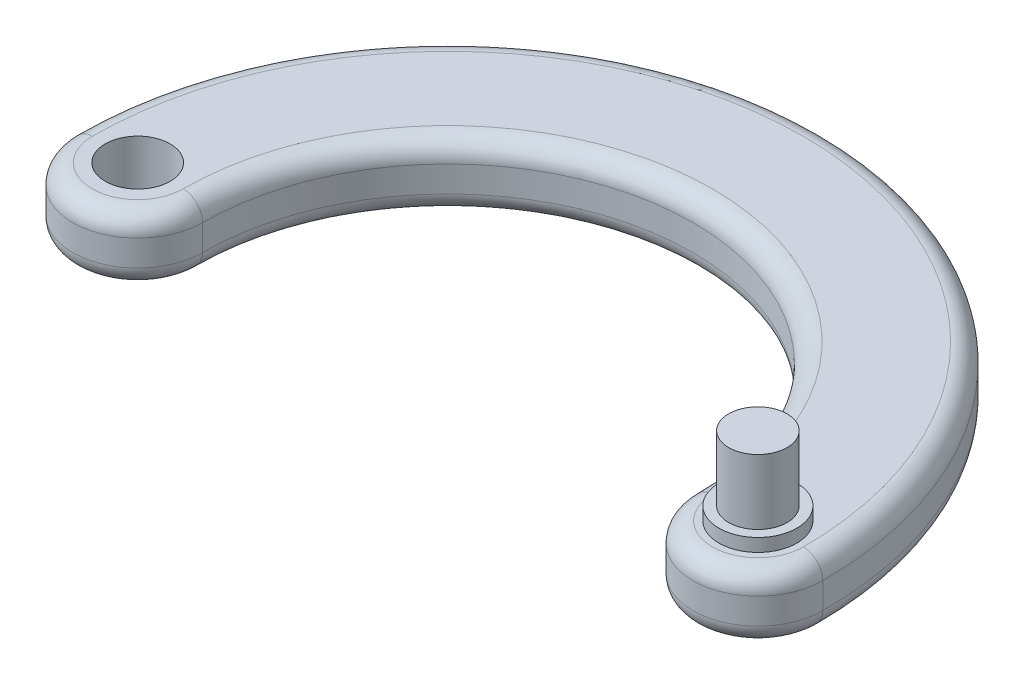
ISO-10303-21;
HEADER;
FILE_DESCRIPTION(('STEP AP214'),'2;1');
FILE_NAME('part.step','',(''),(''),'','','');
FILE_SCHEMA(('AUTOMOTIVE_DESIGN { 1 0 10303 214 1 1 1 1 }'));
ENDSEC;
DATA;
#1=APPLICATION_CONTEXT('core data for automotive mechanical design processes');
#2=APPLICATION_PROTOCOL_DEFINITION('international standard','automotive_design',2000,#1);
#3=PRODUCT_CONTEXT('',#1,'mechanical');
#4=PRODUCT('Part','Part','',(#3));
#5=PRODUCT_RELATED_PRODUCT_CATEGORY('part','',(#4));
#6=PRODUCT_DEFINITION_FORMATION('','',#4);
#7=PRODUCT_DEFINITION_CONTEXT('part definition',#1,'design');
#8=PRODUCT_DEFINITION('design','',#6,#7);
#9=PRODUCT_DEFINITION_SHAPE('','',#8);
#10=(LENGTH_UNIT() NAMED_UNIT(*) SI_UNIT(.MILLI.,.METRE.));
#11=(NAMED_UNIT(*) PLANE_ANGLE_UNIT() SI_UNIT($,.RADIAN.));
#12=(NAMED_UNIT(*) SI_UNIT($,.STERADIAN.) SOLID_ANGLE_UNIT());
#13=UNCERTAINTY_MEASURE_WITH_UNIT(LENGTH_MEASURE(1.E-05),#10,'distance_accuracy_value','');
#14=(GEOMETRIC_REPRESENTATION_CONTEXT(3) GLOBAL_UNCERTAINTY_ASSIGNED_CONTEXT((#13)) GLOBAL_UNIT_ASSIGNED_CONTEXT((#10,
#11,#12)) REPRESENTATION_CONTEXT('',''));
#15=CARTESIAN_POINT('',(0.,0.,0.));
#16=DIRECTION('',(0.,0.,1.));
#17=DIRECTION('',(1.,0.,0.));
#18=AXIS2_PLACEMENT_3D('',#15,#16,#17);
#19=CARTESIAN_POINT('',(-71.625,10.,0.));
#20=DIRECTION('',(0.,1.,0.));
#21=DIRECTION('',(0.,0.,1.));
#22=AXIS2_PLACEMENT_3D('',#19,#20,#21);
#23=PLANE('',#22);
#24=CARTESIAN_POINT('',(0.,10.,0.));
#25=DIRECTION('',(0.,1.,0.));
#26=DIRECTION('',(0.,0.,1.));
#27=AXIS2_PLACEMENT_3D('',#24,#25,#26);
#28=CIRCLE('',#27,7.);
#29=CARTESIAN_POINT('',(-7.00000000000001,10.,0.));
#30=VERTEX_POINT('',#29);
#31=CARTESIAN_POINT('',(7.,10.,0.));
#32=VERTEX_POINT('',#31);
#33=EDGE_CURVE('E42',#30,#32,#28,.T.);
#34=ORIENTED_EDGE('',*,*,#33,.T.);
#35=CARTESIAN_POINT('',(-47.75,10.,0.));
#36=DIRECTION('',(0.,1.,0.));
#37=DIRECTION('',(0.,0.,1.));
#38=AXIS2_PLACEMENT_3D('',#35,#36,#37);
#39=CIRCLE('',#38,54.75);
#40=CARTESIAN_POINT('',(-102.5,10.,0.));
#41=VERTEX_POINT('',#40);
#42=EDGE_CURVE('E11',#32,#41,#39,.T.);
#43=ORIENTED_EDGE('',*,*,#42,.T.);
#44=CARTESIAN_POINT('',(-95.5,10.,0.));
#45=DIRECTION('',(0.,1.,0.));
#46=DIRECTION('',(0.,0.,1.));
#47=AXIS2_PLACEMENT_3D('',#44,#45,#46);
#48=CIRCLE('',#47,7.00000000000001);
#49=CARTESIAN_POINT('',(-88.5,10.,0.));
#50=VERTEX_POINT('',#49);
#51=EDGE_CURVE('E205',#41,#50,#48,.T.);
#52=ORIENTED_EDGE('',*,*,#51,.T.);
#53=CARTESIAN_POINT('',(-47.75,10.,0.));
#54=DIRECTION('',(0.,1.,0.));
#55=DIRECTION('',(0.,0.,1.));
#56=AXIS2_PLACEMENT_3D('',#53,#54,#55);
#57=CIRCLE('',#56,40.75);
#58=EDGE_CURVE('E203',#50,#30,#57,.F.);
#59=ORIENTED_EDGE('',*,*,#58,.T.);
#60=EDGE_LOOP('',(#34,#43,#52,#59));
#61=FACE_BOUND('',#60,.T.);
#62=CARTESIAN_POINT('',(0.,10.,0.));
#63=DIRECTION('',(0.,1.,0.));
#64=DIRECTION('',(0.,0.,1.));
#65=AXIS2_PLACEMENT_3D('',#62,#63,#64);
#66=CIRCLE('',#65,6.);
#67=CARTESIAN_POINT('',(0.,10.,6.));
#68=VERTEX_POINT('',#67);
#69=EDGE_CURVE('E157',#68,#68,#66,.T.);
#70=ORIENTED_EDGE('',*,*,#69,.F.);
#71=EDGE_LOOP('',(#70));
#72=FACE_BOUND('',#71,.T.);
#73=CARTESIAN_POINT('',(-95.5,10.,0.));
#74=DIRECTION('',(0.,1.,0.));
#75=DIRECTION('',(0.,0.,1.));
#76=AXIS2_PLACEMENT_3D('',#73,#74,#75);
#77=CIRCLE('',#76,5.);
#78=CARTESIAN_POINT('',(-95.5,10.,5.00000000000002));
#79=VERTEX_POINT('',#78);
#80=EDGE_CURVE('E123',#79,#79,#77,.T.);
#81=ORIENTED_EDGE('',*,*,#80,.F.);
#82=EDGE_LOOP('',(#81));
#83=FACE_BOUND('',#82,.T.);
#84=ADVANCED_FACE('F33',(#61,#72,#83),#23,.T.);
#85=CARTESIAN_POINT('',(-71.625,0.,0.));
#86=DIRECTION('',(0.,1.,0.));
#87=DIRECTION('',(0.,0.,1.));
#88=AXIS2_PLACEMENT_3D('',#85,#86,#87);
#89=PLANE('',#88);
#90=CARTESIAN_POINT('',(-47.75,0.,0.));
#91=DIRECTION('',(0.,1.,0.));
#92=DIRECTION('',(0.,0.,1.));
#93=AXIS2_PLACEMENT_3D('',#90,#91,#92);
#94=CIRCLE('',#93,54.75);
#95=CARTESIAN_POINT('',(-102.5,0.,0.));
#96=VERTEX_POINT('',#95);
#97=CARTESIAN_POINT('',(7.00000000000001,0.,0.));
#98=VERTEX_POINT('',#97);
#99=EDGE_CURVE('E186',#96,#98,#94,.F.);
#100=ORIENTED_EDGE('',*,*,#99,.T.);
#101=CARTESIAN_POINT('',(0.,0.,0.));
#102=DIRECTION('',(0.,1.,0.));
#103=DIRECTION('',(0.,0.,1.));
#104=AXIS2_PLACEMENT_3D('',#101,#102,#103);
#105=CIRCLE('',#104,7.);
#106=CARTESIAN_POINT('',(-7.00000000000001,0.,0.));
#107=VERTEX_POINT('',#106);
#108=EDGE_CURVE('E192',#98,#107,#105,.F.);
#109=ORIENTED_EDGE('',*,*,#108,.T.);
#110=CARTESIAN_POINT('',(-47.75,0.,0.));
#111=DIRECTION('',(0.,1.,0.));
#112=DIRECTION('',(0.,0.,1.));
#113=AXIS2_PLACEMENT_3D('',#110,#111,#112);
#114=CIRCLE('',#113,40.75);
#115=CARTESIAN_POINT('',(-88.5,0.,0.));
#116=VERTEX_POINT('',#115);
#117=EDGE_CURVE('E190',#107,#116,#114,.T.);
#118=ORIENTED_EDGE('',*,*,#117,.T.);
#119=CARTESIAN_POINT('',(-95.5,0.,0.));
#120=DIRECTION('',(0.,1.,0.));
#121=DIRECTION('',(0.,0.,1.));
#122=AXIS2_PLACEMENT_3D('',#119,#120,#121);
#123=CIRCLE('',#122,7.00000000000001);
#124=EDGE_CURVE('E188',#116,#96,#123,.F.);
#125=ORIENTED_EDGE('',*,*,#124,.T.);
#126=EDGE_LOOP('',(#100,#109,#118,#125));
#127=FACE_BOUND('',#126,.T.);
#128=CARTESIAN_POINT('',(-95.5,0.,0.));
#129=DIRECTION('',(0.,1.,0.));
#130=DIRECTION('',(0.,0.,1.));
#131=AXIS2_PLACEMENT_3D('',#128,#129,#130);
#132=CIRCLE('',#131,5.);
#133=CARTESIAN_POINT('',(-95.5,0.,5.00000000000002));
#134=VERTEX_POINT('',#133);
#135=EDGE_CURVE('E173',#134,#134,#132,.T.);
#136=ORIENTED_EDGE('',*,*,#135,.T.);
#137=EDGE_LOOP('',(#136));
#138=FACE_BOUND('',#137,.T.);
#139=ADVANCED_FACE('F225',(#127,#138),#89,.F.);
#140=CARTESIAN_POINT('',(-47.75,10.,0.));
#141=DIRECTION('',(0.,-1.,0.));
#142=DIRECTION('',(0.,0.,-1.));
#143=AXIS2_PLACEMENT_3D('',#140,#141,#142);
#144=CYLINDRICAL_SURFACE('',#143,57.75);
#145=DIRECTION('',(0.,-1.,0.));
#146=VECTOR('',#145,1.);
#147=CARTESIAN_POINT('',(10.,10.,0.));
#148=LINE('',#147,#146);
#149=CARTESIAN_POINT('',(10.,7.,0.));
#150=VERTEX_POINT('',#149);
#151=CARTESIAN_POINT('',(10.,3.,0.));
#152=VERTEX_POINT('',#151);
#153=EDGE_CURVE('E104',#150,#152,#148,.T.);
#154=ORIENTED_EDGE('',*,*,#153,.T.);
#155=CARTESIAN_POINT('',(-47.75,3.,0.));
#156=DIRECTION('',(0.,1.,0.));
#157=DIRECTION('',(0.,0.,1.));
#158=AXIS2_PLACEMENT_3D('',#155,#156,#157);
#159=CIRCLE('',#158,57.75);
#160=CARTESIAN_POINT('',(-105.5,3.,0.));
#161=VERTEX_POINT('',#160);
#162=EDGE_CURVE('E110',#152,#161,#159,.T.);
#163=ORIENTED_EDGE('',*,*,#162,.T.);
#164=DIRECTION('',(0.,-1.,0.));
#165=VECTOR('',#164,1.);
#166=CARTESIAN_POINT('',(-105.5,10.,0.));
#167=LINE('',#166,#165);
#168=CARTESIAN_POINT('',(-105.5,7.,0.));
#169=VERTEX_POINT('',#168);
#170=EDGE_CURVE('E106',#169,#161,#167,.T.);
#171=ORIENTED_EDGE('',*,*,#170,.F.);
#172=CARTESIAN_POINT('',(-47.75,7.,0.));
#173=DIRECTION('',(0.,1.,0.));
#174=DIRECTION('',(0.,0.,1.));
#175=AXIS2_PLACEMENT_3D('',#172,#173,#174);
#176=CIRCLE('',#175,57.75);
#177=EDGE_CURVE('E101',#169,#150,#176,.F.);
#178=ORIENTED_EDGE('',*,*,#177,.T.);
#179=EDGE_LOOP('',(#154,#163,#171,#178));
#180=FACE_BOUND('',#179,.T.);
#181=ADVANCED_FACE('F103',(#180),#144,.T.);
#182=CARTESIAN_POINT('',(-95.5,10.,0.));
#183=DIRECTION('',(0.,-1.,0.));
#184=DIRECTION('',(0.,0.,-1.));
#185=AXIS2_PLACEMENT_3D('',#182,#183,#184);
#186=CYLINDRICAL_SURFACE('',#185,10.);
#187=ORIENTED_EDGE('',*,*,#170,.T.);
#188=CARTESIAN_POINT('',(-95.5,3.,0.));
#189=DIRECTION('',(0.,1.,0.));
#190=DIRECTION('',(0.,0.,1.));
#191=AXIS2_PLACEMENT_3D('',#188,#189,#190);
#192=CIRCLE('',#191,10.);
#193=CARTESIAN_POINT('',(-85.5,3.,0.));
#194=VERTEX_POINT('',#193);
#195=EDGE_CURVE('E111',#161,#194,#192,.T.);
#196=ORIENTED_EDGE('',*,*,#195,.T.);
#197=DIRECTION('',(0.,-1.,0.));
#198=VECTOR('',#197,1.);
#199=CARTESIAN_POINT('',(-85.5,10.,0.));
#200=LINE('',#199,#198);
#201=CARTESIAN_POINT('',(-85.5,7.,0.));
#202=VERTEX_POINT('',#201);
#203=EDGE_CURVE('E179',#202,#194,#200,.T.);
#204=ORIENTED_EDGE('',*,*,#203,.F.);
#205=CARTESIAN_POINT('',(-95.5,7.,0.));
#206=DIRECTION('',(0.,1.,0.));
#207=DIRECTION('',(0.,0.,1.));
#208=AXIS2_PLACEMENT_3D('',#205,#206,#207);
#209=CIRCLE('',#208,10.);
#210=EDGE_CURVE('E199',#202,#169,#209,.F.);
#211=ORIENTED_EDGE('',*,*,#210,.T.);
#212=EDGE_LOOP('',(#187,#196,#204,#211));
#213=FACE_BOUND('',#212,.T.);
#214=ADVANCED_FACE('F213',(#213),#186,.T.);
#215=CARTESIAN_POINT('',(-47.75,10.,0.));
#216=DIRECTION('',(0.,-1.,0.));
#217=DIRECTION('',(0.,0.,-1.));
#218=AXIS2_PLACEMENT_3D('',#215,#216,#217);
#219=CYLINDRICAL_SURFACE('',#218,37.75);
#220=ORIENTED_EDGE('',*,*,#203,.T.);
#221=CARTESIAN_POINT('',(-47.75,3.,0.));
#222=DIRECTION('',(0.,1.,0.));
#223=DIRECTION('',(0.,0.,1.));
#224=AXIS2_PLACEMENT_3D('',#221,#222,#223);
#225=CIRCLE('',#224,37.75);
#226=CARTESIAN_POINT('',(-10.,3.,0.));
#227=VERTEX_POINT('',#226);
#228=EDGE_CURVE('E197',#194,#227,#225,.F.);
#229=ORIENTED_EDGE('',*,*,#228,.T.);
#230=DIRECTION('',(0.,-1.,0.));
#231=VECTOR('',#230,1.);
#232=CARTESIAN_POINT('',(-10.,10.,0.));
#233=LINE('',#232,#231);
#234=CARTESIAN_POINT('',(-10.,7.,0.));
#235=VERTEX_POINT('',#234);
#236=EDGE_CURVE('E122',#235,#227,#233,.T.);
#237=ORIENTED_EDGE('',*,*,#236,.F.);
#238=CARTESIAN_POINT('',(-47.75,7.,0.));
#239=DIRECTION('',(0.,1.,0.));
#240=DIRECTION('',(0.,0.,1.));
#241=AXIS2_PLACEMENT_3D('',#238,#239,#240);
#242=CIRCLE('',#241,37.75);
#243=EDGE_CURVE('E195',#235,#202,#242,.T.);
#244=ORIENTED_EDGE('',*,*,#243,.T.);
#245=EDGE_LOOP('',(#220,#229,#237,#244));
#246=FACE_BOUND('',#245,.T.);
#247=ADVANCED_FACE('F210',(#246),#219,.F.);
#248=CARTESIAN_POINT('',(0.,10.,0.));
#249=DIRECTION('',(0.,-1.,0.));
#250=DIRECTION('',(0.,0.,-1.));
#251=AXIS2_PLACEMENT_3D('',#248,#249,#250);
#252=CYLINDRICAL_SURFACE('',#251,10.);
#253=ORIENTED_EDGE('',*,*,#236,.T.);
#254=CARTESIAN_POINT('',(0.,3.,0.));
#255=DIRECTION('',(0.,1.,0.));
#256=DIRECTION('',(0.,0.,1.));
#257=AXIS2_PLACEMENT_3D('',#254,#255,#256);
#258=CIRCLE('',#257,10.);
#259=EDGE_CURVE('E121',#227,#152,#258,.T.);
#260=ORIENTED_EDGE('',*,*,#259,.T.);
#261=ORIENTED_EDGE('',*,*,#153,.F.);
#262=CARTESIAN_POINT('',(0.,7.,0.));
#263=DIRECTION('',(0.,1.,0.));
#264=DIRECTION('',(0.,0.,1.));
#265=AXIS2_PLACEMENT_3D('',#262,#263,#264);
#266=CIRCLE('',#265,10.);
#267=EDGE_CURVE('E118',#150,#235,#266,.F.);
#268=ORIENTED_EDGE('',*,*,#267,.T.);
#269=EDGE_LOOP('',(#253,#260,#261,#268));
#270=FACE_BOUND('',#269,.T.);
#271=ADVANCED_FACE('F117',(#270),#252,.T.);
#272=CARTESIAN_POINT('',(-95.5,10.,0.));
#273=DIRECTION('',(0.,-1.,0.));
#274=DIRECTION('',(0.,0.,-1.));
#275=AXIS2_PLACEMENT_3D('',#272,#273,#274);
#276=CYLINDRICAL_SURFACE('',#275,5.);
#277=ORIENTED_EDGE('',*,*,#80,.T.);
#278=EDGE_LOOP('',(#277));
#279=FACE_BOUND('',#278,.T.);
#280=ORIENTED_EDGE('',*,*,#135,.F.);
#281=EDGE_LOOP('',(#280));
#282=FACE_BOUND('',#281,.T.);
#283=ADVANCED_FACE('F233',(#279,#282),#276,.F.);
#284=CARTESIAN_POINT('',(0.,12.,0.));
#285=DIRECTION('',(0.,-1.,0.));
#286=DIRECTION('',(0.,0.,-1.));
#287=AXIS2_PLACEMENT_3D('',#284,#285,#286);
#288=CYLINDRICAL_SURFACE('',#287,6.);
#289=CARTESIAN_POINT('',(0.,12.,0.));
#290=DIRECTION('',(0.,1.,0.));
#291=DIRECTION('',(0.,0.,1.));
#292=AXIS2_PLACEMENT_3D('',#289,#290,#291);
#293=CIRCLE('',#292,6.);
#294=CARTESIAN_POINT('',(0.,12.,6.));
#295=VERTEX_POINT('',#294);
#296=EDGE_CURVE('E163',#295,#295,#293,.T.);
#297=ORIENTED_EDGE('',*,*,#296,.F.);
#298=EDGE_LOOP('',(#297));
#299=FACE_BOUND('',#298,.T.);
#300=ORIENTED_EDGE('',*,*,#69,.T.);
#301=EDGE_LOOP('',(#300));
#302=FACE_BOUND('',#301,.T.);
#303=ADVANCED_FACE('F308',(#299,#302),#288,.T.);
#304=CARTESIAN_POINT('',(0.,12.,0.));
#305=DIRECTION('',(0.,1.,0.));
#306=DIRECTION('',(0.,0.,1.));
#307=AXIS2_PLACEMENT_3D('',#304,#305,#306);
#308=PLANE('',#307);
#309=CARTESIAN_POINT('',(0.,12.,0.));
#310=DIRECTION('',(0.,1.,0.));
#311=DIRECTION('',(0.,0.,1.));
#312=AXIS2_PLACEMENT_3D('',#309,#310,#311);
#313=CIRCLE('',#312,4.5);
#314=CARTESIAN_POINT('',(0.,12.,4.5));
#315=VERTEX_POINT('',#314);
#316=EDGE_CURVE('E129',#315,#315,#313,.F.);
#317=ORIENTED_EDGE('',*,*,#316,.T.);
#318=EDGE_LOOP('',(#317));
#319=FACE_BOUND('',#318,.T.);
#320=ORIENTED_EDGE('',*,*,#296,.T.);
#321=EDGE_LOOP('',(#320));
#322=FACE_BOUND('',#321,.T.);
#323=ADVANCED_FACE('F301',(#319,#322),#308,.T.);
#324=CARTESIAN_POINT('',(0.,22.,0.));
#325=DIRECTION('',(0.,1.,0.));
#326=DIRECTION('',(0.,0.,1.));
#327=AXIS2_PLACEMENT_3D('',#324,#325,#326);
#328=PLANE('',#327);
#329=CARTESIAN_POINT('',(0.,22.,0.));
#330=DIRECTION('',(0.,1.,0.));
#331=DIRECTION('',(0.,0.,1.));
#332=AXIS2_PLACEMENT_3D('',#329,#330,#331);
#333=CIRCLE('',#332,4.5);
#334=CARTESIAN_POINT('',(0.,22.,4.5));
#335=VERTEX_POINT('',#334);
#336=EDGE_CURVE('E168',#335,#335,#333,.T.);
#337=ORIENTED_EDGE('',*,*,#336,.T.);
#338=EDGE_LOOP('',(#337));
#339=FACE_BOUND('',#338,.T.);
#340=ADVANCED_FACE('F307',(#339),#328,.T.);
#341=CARTESIAN_POINT('',(0.,-12.7279220613579,0.));
#342=DIRECTION('',(0.,1.,0.));
#343=DIRECTION('',(0.,0.,1.));
#344=AXIS2_PLACEMENT_3D('',#341,#342,#343);
#345=CYLINDRICAL_SURFACE('',#344,4.5);
#346=ORIENTED_EDGE('',*,*,#316,.F.);
#347=EDGE_LOOP('',(#346));
#348=FACE_BOUND('',#347,.T.);
#349=ORIENTED_EDGE('',*,*,#336,.F.);
#350=EDGE_LOOP('',(#349));
#351=FACE_BOUND('',#350,.T.);
#352=ADVANCED_FACE('F252',(#348,#351),#345,.T.);
#353=CARTESIAN_POINT('',(-95.5,3.,0.));
#354=DIRECTION('',(0.,1.,0.));
#355=DIRECTION('',(0.,0.,1.));
#356=AXIS2_PLACEMENT_3D('',#353,#354,#355);
#357=TOROIDAL_SURFACE('',#356,7.00000000000001,3.);
#358=CARTESIAN_POINT('',(-102.5,3.,0.));
#359=DIRECTION('',(0.,0.,-1.));
#360=DIRECTION('',(-1.,0.,0.));
#361=AXIS2_PLACEMENT_3D('',#358,#359,#360);
#362=CIRCLE('',#361,3.);
#363=EDGE_CURVE('E149',#96,#161,#362,.T.);
#364=ORIENTED_EDGE('',*,*,#363,.F.);
#365=ORIENTED_EDGE('',*,*,#124,.F.);
#366=CARTESIAN_POINT('',(-88.5,3.,0.));
#367=DIRECTION('',(0.,0.,-1.));
#368=DIRECTION('',(0.,1.,0.));
#369=AXIS2_PLACEMENT_3D('',#366,#367,#368);
#370=CIRCLE('',#369,3.);
#371=EDGE_CURVE('E136',#194,#116,#370,.T.);
#372=ORIENTED_EDGE('',*,*,#371,.F.);
#373=ORIENTED_EDGE('',*,*,#195,.F.);
#374=EDGE_LOOP('',(#364,#365,#372,#373));
#375=FACE_BOUND('',#374,.T.);
#376=ADVANCED_FACE('F249',(#375),#357,.T.);
#377=CARTESIAN_POINT('',(-47.75,3.,0.));
#378=DIRECTION('',(0.,1.,0.));
#379=DIRECTION('',(0.,0.,1.));
#380=AXIS2_PLACEMENT_3D('',#377,#378,#379);
#381=TOROIDAL_SURFACE('',#380,40.75,3.);
#382=ORIENTED_EDGE('',*,*,#371,.T.);
#383=ORIENTED_EDGE('',*,*,#117,.F.);
#384=CARTESIAN_POINT('',(-7.00000000000001,3.,0.));
#385=DIRECTION('',(0.,0.,1.));
#386=DIRECTION('',(0.,-1.,0.));
#387=AXIS2_PLACEMENT_3D('',#384,#385,#386);
#388=CIRCLE('',#387,3.);
#389=EDGE_CURVE('E143',#227,#107,#388,.T.);
#390=ORIENTED_EDGE('',*,*,#389,.F.);
#391=ORIENTED_EDGE('',*,*,#228,.F.);
#392=EDGE_LOOP('',(#382,#383,#390,#391));
#393=FACE_BOUND('',#392,.T.);
#394=ADVANCED_FACE('F246',(#393),#381,.T.);
#395=CARTESIAN_POINT('',(-47.75,3.,0.));
#396=DIRECTION('',(0.,1.,0.));
#397=DIRECTION('',(0.,0.,1.));
#398=AXIS2_PLACEMENT_3D('',#395,#396,#397);
#399=TOROIDAL_SURFACE('',#398,54.75,3.);
#400=ORIENTED_EDGE('',*,*,#363,.T.);
#401=ORIENTED_EDGE('',*,*,#162,.F.);
#402=CARTESIAN_POINT('',(7.00000000000001,3.,0.));
#403=DIRECTION('',(0.,0.,1.));
#404=DIRECTION('',(1.,0.,0.));
#405=AXIS2_PLACEMENT_3D('',#402,#403,#404);
#406=CIRCLE('',#405,3.);
#407=EDGE_CURVE('E139',#98,#152,#406,.T.);
#408=ORIENTED_EDGE('',*,*,#407,.F.);
#409=ORIENTED_EDGE('',*,*,#99,.F.);
#410=EDGE_LOOP('',(#400,#401,#408,#409));
#411=FACE_BOUND('',#410,.T.);
#412=ADVANCED_FACE('F222',(#411),#399,.T.);
#413=CARTESIAN_POINT('',(0.,3.,0.));
#414=DIRECTION('',(0.,1.,0.));
#415=DIRECTION('',(0.,0.,1.));
#416=AXIS2_PLACEMENT_3D('',#413,#414,#415);
#417=TOROIDAL_SURFACE('',#416,7.,3.);
#418=ORIENTED_EDGE('',*,*,#389,.T.);
#419=ORIENTED_EDGE('',*,*,#108,.F.);
#420=ORIENTED_EDGE('',*,*,#407,.T.);
#421=ORIENTED_EDGE('',*,*,#259,.F.);
#422=EDGE_LOOP('',(#418,#419,#420,#421));
#423=FACE_BOUND('',#422,.T.);
#424=ADVANCED_FACE('F217',(#423),#417,.T.);
#425=CARTESIAN_POINT('',(-95.5,7.,0.));
#426=DIRECTION('',(0.,1.,0.));
#427=DIRECTION('',(0.,0.,1.));
#428=AXIS2_PLACEMENT_3D('',#425,#426,#427);
#429=TOROIDAL_SURFACE('',#428,7.00000000000001,3.);
#430=CARTESIAN_POINT('',(-102.5,7.,0.));
#431=DIRECTION('',(0.,0.,-1.));
#432=DIRECTION('',(-1.,0.,0.));
#433=AXIS2_PLACEMENT_3D('',#430,#431,#432);
#434=CIRCLE('',#433,3.);
#435=EDGE_CURVE('E133',#169,#41,#434,.T.);
#436=ORIENTED_EDGE('',*,*,#435,.F.);
#437=ORIENTED_EDGE('',*,*,#210,.F.);
#438=CARTESIAN_POINT('',(-88.5,7.,0.));
#439=DIRECTION('',(0.,0.,-1.));
#440=DIRECTION('',(-1.,0.,0.));
#441=AXIS2_PLACEMENT_3D('',#438,#439,#440);
#442=CIRCLE('',#441,3.);
#443=EDGE_CURVE('E37',#50,#202,#442,.T.);
#444=ORIENTED_EDGE('',*,*,#443,.F.);
#445=ORIENTED_EDGE('',*,*,#51,.F.);
#446=EDGE_LOOP('',(#436,#437,#444,#445));
#447=FACE_BOUND('',#446,.T.);
#448=ADVANCED_FACE('F35',(#447),#429,.T.);
#449=CARTESIAN_POINT('',(-47.75,7.,0.));
#450=DIRECTION('',(0.,1.,0.));
#451=DIRECTION('',(0.,0.,1.));
#452=AXIS2_PLACEMENT_3D('',#449,#450,#451);
#453=TOROIDAL_SURFACE('',#452,40.75,3.);
#454=ORIENTED_EDGE('',*,*,#443,.T.);
#455=ORIENTED_EDGE('',*,*,#243,.F.);
#456=CARTESIAN_POINT('',(-7.00000000000001,7.,0.));
#457=DIRECTION('',(0.,0.,1.));
#458=DIRECTION('',(1.,0.,0.));
#459=AXIS2_PLACEMENT_3D('',#456,#457,#458);
#460=CIRCLE('',#459,3.);
#461=EDGE_CURVE('E127',#30,#235,#460,.T.);
#462=ORIENTED_EDGE('',*,*,#461,.F.);
#463=ORIENTED_EDGE('',*,*,#58,.F.);
#464=EDGE_LOOP('',(#454,#455,#462,#463));
#465=FACE_BOUND('',#464,.T.);
#466=ADVANCED_FACE('F207',(#465),#453,.T.);
#467=CARTESIAN_POINT('',(-47.75,7.,0.));
#468=DIRECTION('',(0.,1.,0.));
#469=DIRECTION('',(0.,0.,1.));
#470=AXIS2_PLACEMENT_3D('',#467,#468,#469);
#471=TOROIDAL_SURFACE('',#470,54.75,3.);
#472=ORIENTED_EDGE('',*,*,#435,.T.);
#473=ORIENTED_EDGE('',*,*,#42,.F.);
#474=CARTESIAN_POINT('',(7.00000000000001,7.,0.));
#475=DIRECTION('',(0.,0.,1.));
#476=DIRECTION('',(0.,-1.,0.));
#477=AXIS2_PLACEMENT_3D('',#474,#475,#476);
#478=CIRCLE('',#477,3.);
#479=EDGE_CURVE('E50',#150,#32,#478,.T.);
#480=ORIENTED_EDGE('',*,*,#479,.F.);
#481=ORIENTED_EDGE('',*,*,#177,.F.);
#482=EDGE_LOOP('',(#472,#473,#480,#481));
#483=FACE_BOUND('',#482,.T.);
#484=ADVANCED_FACE('F131',(#483),#471,.T.);
#485=CARTESIAN_POINT('',(0.,7.,0.));
#486=DIRECTION('',(0.,1.,0.));
#487=DIRECTION('',(0.,0.,1.));
#488=AXIS2_PLACEMENT_3D('',#485,#486,#487);
#489=TOROIDAL_SURFACE('',#488,7.,3.);
#490=ORIENTED_EDGE('',*,*,#461,.T.);
#491=ORIENTED_EDGE('',*,*,#267,.F.);
#492=ORIENTED_EDGE('',*,*,#479,.T.);
#493=ORIENTED_EDGE('',*,*,#33,.F.);
#494=EDGE_LOOP('',(#490,#491,#492,#493));
#495=FACE_BOUND('',#494,.T.);
#496=ADVANCED_FACE('F125',(#495),#489,.T.);
#497=CLOSED_SHELL('',(#84,#139,#181,#214,#247,#271,#283,#303,#323,#340,#352,#376,#394,#412,#424,
#448,#466,#484,#496));
#498=MANIFOLD_SOLID_BREP('B2',#497);
#499=ADVANCED_BREP_SHAPE_REPRESENTATION('',(#18,#498),#14);
#500=SHAPE_DEFINITION_REPRESENTATION(#9,#499);
ENDSEC;
END-ISO-10303-21;
